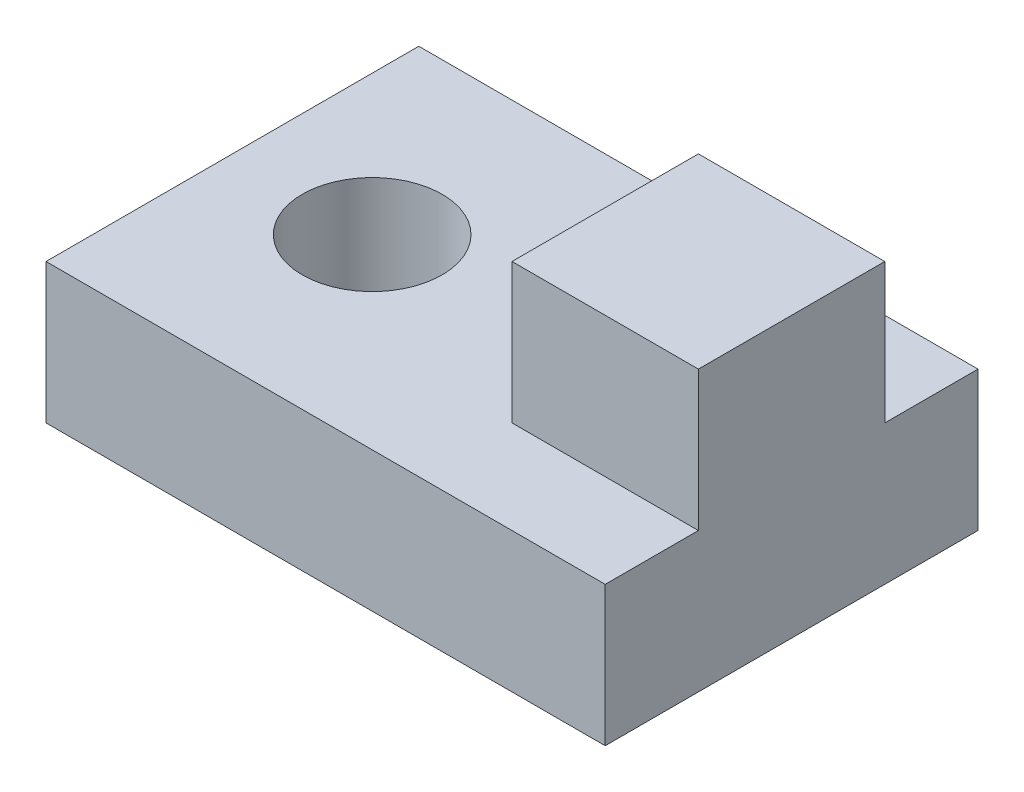
ISO-10303-21;
HEADER;
FILE_DESCRIPTION(('STEP AP214'),'2;1');
FILE_NAME('part.step','',(''),(''),'','','');
FILE_SCHEMA(('AUTOMOTIVE_DESIGN { 1 0 10303 214 1 1 1 1 }'));
ENDSEC;
DATA;
#1=APPLICATION_CONTEXT('core data for automotive mechanical design processes');
#2=APPLICATION_PROTOCOL_DEFINITION('international standard','automotive_design',2000,#1);
#3=PRODUCT_CONTEXT('',#1,'mechanical');
#4=PRODUCT('Part','Part','',(#3));
#5=PRODUCT_RELATED_PRODUCT_CATEGORY('part','',(#4));
#6=PRODUCT_DEFINITION_FORMATION('','',#4);
#7=PRODUCT_DEFINITION_CONTEXT('part definition',#1,'design');
#8=PRODUCT_DEFINITION('design','',#6,#7);
#9=PRODUCT_DEFINITION_SHAPE('','',#8);
#10=(LENGTH_UNIT() NAMED_UNIT(*) SI_UNIT(.MILLI.,.METRE.));
#11=(NAMED_UNIT(*) PLANE_ANGLE_UNIT() SI_UNIT($,.RADIAN.));
#12=(NAMED_UNIT(*) SI_UNIT($,.STERADIAN.) SOLID_ANGLE_UNIT());
#13=UNCERTAINTY_MEASURE_WITH_UNIT(LENGTH_MEASURE(1.E-05),#10,'distance_accuracy_value','');
#14=(GEOMETRIC_REPRESENTATION_CONTEXT(3) GLOBAL_UNCERTAINTY_ASSIGNED_CONTEXT((#13)) GLOBAL_UNIT_ASSIGNED_CONTEXT((#10,
#11,#12)) REPRESENTATION_CONTEXT('',''));
#15=CARTESIAN_POINT('',(0.,0.,0.));
#16=DIRECTION('',(0.,0.,1.));
#17=DIRECTION('',(1.,0.,0.));
#18=AXIS2_PLACEMENT_3D('',#15,#16,#17);
#19=CARTESIAN_POINT('',(-30.,15.,-20.));
#20=DIRECTION('',(1.,0.,0.));
#21=DIRECTION('',(0.,0.,-1.));
#22=AXIS2_PLACEMENT_3D('',#19,#20,#21);
#23=PLANE('',#22);
#24=DIRECTION('',(0.,0.,1.));
#25=VECTOR('',#24,1.);
#26=CARTESIAN_POINT('',(-30.,0.,-20.));
#27=LINE('',#26,#25);
#28=CARTESIAN_POINT('',(-30.,0.,-20.));
#29=VERTEX_POINT('',#28);
#30=CARTESIAN_POINT('',(-30.,0.,20.));
#31=VERTEX_POINT('',#30);
#32=EDGE_CURVE('E145',#29,#31,#27,.T.);
#33=ORIENTED_EDGE('',*,*,#32,.T.);
#34=DIRECTION('',(0.,-1.,0.));
#35=VECTOR('',#34,1.);
#36=CARTESIAN_POINT('',(-30.,15.,20.));
#37=LINE('',#36,#35);
#38=CARTESIAN_POINT('',(-30.,15.,20.));
#39=VERTEX_POINT('',#38);
#40=EDGE_CURVE('E11',#39,#31,#37,.T.);
#41=ORIENTED_EDGE('',*,*,#40,.F.);
#42=DIRECTION('',(0.,0.,1.));
#43=VECTOR('',#42,1.);
#44=CARTESIAN_POINT('',(-30.,15.,-20.));
#45=LINE('',#44,#43);
#46=CARTESIAN_POINT('',(-30.,15.,-20.));
#47=VERTEX_POINT('',#46);
#48=EDGE_CURVE('E146',#47,#39,#45,.T.);
#49=ORIENTED_EDGE('',*,*,#48,.F.);
#50=DIRECTION('',(0.,-1.,0.));
#51=VECTOR('',#50,1.);
#52=CARTESIAN_POINT('',(-30.,15.,-20.));
#53=LINE('',#52,#51);
#54=EDGE_CURVE('E160',#47,#29,#53,.T.);
#55=ORIENTED_EDGE('',*,*,#54,.T.);
#56=EDGE_LOOP('',(#33,#41,#49,#55));
#57=FACE_BOUND('',#56,.T.);
#58=ADVANCED_FACE('F40',(#57),#23,.F.);
#59=CARTESIAN_POINT('',(-30.,15.,20.));
#60=DIRECTION('',(0.,0.,-1.));
#61=DIRECTION('',(-1.,0.,0.));
#62=AXIS2_PLACEMENT_3D('',#59,#60,#61);
#63=PLANE('',#62);
#64=DIRECTION('',(1.,0.,0.));
#65=VECTOR('',#64,1.);
#66=CARTESIAN_POINT('',(-30.,0.,20.));
#67=LINE('',#66,#65);
#68=CARTESIAN_POINT('',(30.,0.,20.));
#69=VERTEX_POINT('',#68);
#70=EDGE_CURVE('E164',#31,#69,#67,.T.);
#71=ORIENTED_EDGE('',*,*,#70,.T.);
#72=DIRECTION('',(0.,-1.,0.));
#73=VECTOR('',#72,1.);
#74=CARTESIAN_POINT('',(30.,15.,20.));
#75=LINE('',#74,#73);
#76=CARTESIAN_POINT('',(30.,15.,20.));
#77=VERTEX_POINT('',#76);
#78=EDGE_CURVE('E48',#77,#69,#75,.T.);
#79=ORIENTED_EDGE('',*,*,#78,.F.);
#80=DIRECTION('',(1.,0.,0.));
#81=VECTOR('',#80,1.);
#82=CARTESIAN_POINT('',(-30.,15.,20.));
#83=LINE('',#82,#81);
#84=EDGE_CURVE('E150',#39,#77,#83,.T.);
#85=ORIENTED_EDGE('',*,*,#84,.F.);
#86=ORIENTED_EDGE('',*,*,#40,.T.);
#87=EDGE_LOOP('',(#71,#79,#85,#86));
#88=FACE_BOUND('',#87,.T.);
#89=ADVANCED_FACE('F212',(#88),#63,.F.);
#90=CARTESIAN_POINT('',(30.,15.,-20.));
#91=DIRECTION('',(-1.,0.,0.));
#92=DIRECTION('',(0.,0.,1.));
#93=AXIS2_PLACEMENT_3D('',#90,#91,#92);
#94=PLANE('',#93);
#95=DIRECTION('',(0.,0.,-1.));
#96=VECTOR('',#95,1.);
#97=CARTESIAN_POINT('',(30.,0.,-20.));
#98=LINE('',#97,#96);
#99=CARTESIAN_POINT('',(30.,0.,-20.));
#100=VERTEX_POINT('',#99);
#101=EDGE_CURVE('E167',#69,#100,#98,.T.);
#102=ORIENTED_EDGE('',*,*,#101,.T.);
#103=DIRECTION('',(0.,-1.,0.));
#104=VECTOR('',#103,1.);
#105=CARTESIAN_POINT('',(30.,15.,-20.));
#106=LINE('',#105,#104);
#107=CARTESIAN_POINT('',(30.,15.,-20.));
#108=VERTEX_POINT('',#107);
#109=EDGE_CURVE('E175',#108,#100,#106,.T.);
#110=ORIENTED_EDGE('',*,*,#109,.F.);
#111=DIRECTION('',(0.,0.,-1.));
#112=VECTOR('',#111,1.);
#113=CARTESIAN_POINT('',(30.,15.,-20.));
#114=LINE('',#113,#112);
#115=CARTESIAN_POINT('',(30.,15.,-10.));
#116=VERTEX_POINT('',#115);
#117=EDGE_CURVE('E128',#116,#108,#114,.T.);
#118=ORIENTED_EDGE('',*,*,#117,.F.);
#119=DIRECTION('',(0.,-1.,0.));
#120=VECTOR('',#119,1.);
#121=CARTESIAN_POINT('',(30.,30.,-10.));
#122=LINE('',#121,#120);
#123=CARTESIAN_POINT('',(30.,30.,-10.));
#124=VERTEX_POINT('',#123);
#125=EDGE_CURVE('E108',#124,#116,#122,.T.);
#126=ORIENTED_EDGE('',*,*,#125,.F.);
#127=DIRECTION('',(0.,0.,-1.));
#128=VECTOR('',#127,1.);
#129=CARTESIAN_POINT('',(30.,30.,-10.));
#130=LINE('',#129,#128);
#131=CARTESIAN_POINT('',(30.,30.,10.));
#132=VERTEX_POINT('',#131);
#133=EDGE_CURVE('E115',#132,#124,#130,.T.);
#134=ORIENTED_EDGE('',*,*,#133,.F.);
#135=DIRECTION('',(0.,-1.,0.));
#136=VECTOR('',#135,1.);
#137=CARTESIAN_POINT('',(30.,30.,10.));
#138=LINE('',#137,#136);
#139=CARTESIAN_POINT('',(30.,15.,10.));
#140=VERTEX_POINT('',#139);
#141=EDGE_CURVE('E310',#132,#140,#138,.T.);
#142=ORIENTED_EDGE('',*,*,#141,.T.);
#143=EDGE_CURVE('E154',#77,#140,#114,.T.);
#144=ORIENTED_EDGE('',*,*,#143,.F.);
#145=ORIENTED_EDGE('',*,*,#78,.T.);
#146=EDGE_LOOP('',(#102,#110,#118,#126,#134,#142,#144,#145));
#147=FACE_BOUND('',#146,.T.);
#148=ADVANCED_FACE('F126',(#147),#94,.F.);
#149=CARTESIAN_POINT('',(-30.,15.,-20.));
#150=DIRECTION('',(0.,0.,1.));
#151=DIRECTION('',(1.,0.,0.));
#152=AXIS2_PLACEMENT_3D('',#149,#150,#151);
#153=PLANE('',#152);
#154=DIRECTION('',(-1.,0.,0.));
#155=VECTOR('',#154,1.);
#156=CARTESIAN_POINT('',(-30.,0.,-20.));
#157=LINE('',#156,#155);
#158=EDGE_CURVE('E151',#100,#29,#157,.T.);
#159=ORIENTED_EDGE('',*,*,#158,.T.);
#160=ORIENTED_EDGE('',*,*,#54,.F.);
#161=DIRECTION('',(-1.,0.,0.));
#162=VECTOR('',#161,1.);
#163=CARTESIAN_POINT('',(-30.,15.,-20.));
#164=LINE('',#163,#162);
#165=EDGE_CURVE('E157',#108,#47,#164,.T.);
#166=ORIENTED_EDGE('',*,*,#165,.F.);
#167=ORIENTED_EDGE('',*,*,#109,.T.);
#168=EDGE_LOOP('',(#159,#160,#166,#167));
#169=FACE_BOUND('',#168,.T.);
#170=ADVANCED_FACE('F191',(#169),#153,.F.);
#171=CARTESIAN_POINT('',(0.,15.,0.));
#172=DIRECTION('',(0.,1.,0.));
#173=DIRECTION('',(0.,0.,1.));
#174=AXIS2_PLACEMENT_3D('',#171,#172,#173);
#175=PLANE('',#174);
#176=DIRECTION('',(1.,0.,0.));
#177=VECTOR('',#176,1.);
#178=CARTESIAN_POINT('',(30.,15.,10.));
#179=LINE('',#178,#177);
#180=CARTESIAN_POINT('',(10.,15.,10.));
#181=VERTEX_POINT('',#180);
#182=EDGE_CURVE('E55',#181,#140,#179,.T.);
#183=ORIENTED_EDGE('',*,*,#182,.F.);
#184=DIRECTION('',(0.,0.,1.));
#185=VECTOR('',#184,1.);
#186=CARTESIAN_POINT('',(10.,15.,-10.));
#187=LINE('',#186,#185);
#188=CARTESIAN_POINT('',(10.,15.,-10.));
#189=VERTEX_POINT('',#188);
#190=EDGE_CURVE('E313',#189,#181,#187,.T.);
#191=ORIENTED_EDGE('',*,*,#190,.F.);
#192=DIRECTION('',(-1.,0.,0.));
#193=VECTOR('',#192,1.);
#194=CARTESIAN_POINT('',(30.,15.,-10.));
#195=LINE('',#194,#193);
#196=EDGE_CURVE('E61',#116,#189,#195,.T.);
#197=ORIENTED_EDGE('',*,*,#196,.F.);
#198=ORIENTED_EDGE('',*,*,#117,.T.);
#199=ORIENTED_EDGE('',*,*,#165,.T.);
#200=ORIENTED_EDGE('',*,*,#48,.T.);
#201=ORIENTED_EDGE('',*,*,#84,.T.);
#202=ORIENTED_EDGE('',*,*,#143,.T.);
#203=EDGE_LOOP('',(#183,#191,#197,#198,#199,#200,#201,#202));
#204=FACE_BOUND('',#203,.T.);
#205=CARTESIAN_POINT('',(-15.,15.,0.));
#206=DIRECTION('',(0.,1.,0.));
#207=DIRECTION('',(0.,0.,1.));
#208=AXIS2_PLACEMENT_3D('',#205,#206,#207);
#209=CIRCLE('',#208,7.5);
#210=CARTESIAN_POINT('',(-15.,15.,7.5));
#211=VERTEX_POINT('',#210);
#212=EDGE_CURVE('E130',#211,#211,#209,.T.);
#213=ORIENTED_EDGE('',*,*,#212,.F.);
#214=EDGE_LOOP('',(#213));
#215=FACE_BOUND('',#214,.T.);
#216=ADVANCED_FACE('F196',(#204,#215),#175,.T.);
#217=CARTESIAN_POINT('',(0.,0.,0.));
#218=DIRECTION('',(0.,1.,0.));
#219=DIRECTION('',(0.,0.,1.));
#220=AXIS2_PLACEMENT_3D('',#217,#218,#219);
#221=PLANE('',#220);
#222=CARTESIAN_POINT('',(-15.,0.,0.));
#223=DIRECTION('',(0.,1.,0.));
#224=DIRECTION('',(0.,0.,1.));
#225=AXIS2_PLACEMENT_3D('',#222,#223,#224);
#226=CIRCLE('',#225,7.5);
#227=CARTESIAN_POINT('',(-15.,0.,7.5));
#228=VERTEX_POINT('',#227);
#229=EDGE_CURVE('E136',#228,#228,#226,.F.);
#230=ORIENTED_EDGE('',*,*,#229,.F.);
#231=EDGE_LOOP('',(#230));
#232=FACE_BOUND('',#231,.T.);
#233=ORIENTED_EDGE('',*,*,#32,.F.);
#234=ORIENTED_EDGE('',*,*,#158,.F.);
#235=ORIENTED_EDGE('',*,*,#101,.F.);
#236=ORIENTED_EDGE('',*,*,#70,.F.);
#237=EDGE_LOOP('',(#233,#234,#235,#236));
#238=FACE_BOUND('',#237,.T.);
#239=ADVANCED_FACE('F188',(#232,#238),#221,.F.);
#240=CARTESIAN_POINT('',(-15.,-0.001000000000001,0.));
#241=DIRECTION('',(0.,1.,0.));
#242=DIRECTION('',(0.,0.,1.));
#243=AXIS2_PLACEMENT_3D('',#240,#241,#242);
#244=CYLINDRICAL_SURFACE('',#243,7.5);
#245=ORIENTED_EDGE('',*,*,#212,.T.);
#246=EDGE_LOOP('',(#245));
#247=FACE_BOUND('',#246,.T.);
#248=ORIENTED_EDGE('',*,*,#229,.T.);
#249=EDGE_LOOP('',(#248));
#250=FACE_BOUND('',#249,.T.);
#251=ADVANCED_FACE('F224',(#247,#250),#244,.F.);
#252=CARTESIAN_POINT('',(30.,30.,-10.));
#253=DIRECTION('',(0.,0.,1.));
#254=DIRECTION('',(1.,0.,0.));
#255=AXIS2_PLACEMENT_3D('',#252,#253,#254);
#256=PLANE('',#255);
#257=ORIENTED_EDGE('',*,*,#196,.T.);
#258=DIRECTION('',(0.,-1.,0.));
#259=VECTOR('',#258,1.);
#260=CARTESIAN_POINT('',(10.,30.,-10.));
#261=LINE('',#260,#259);
#262=CARTESIAN_POINT('',(10.,30.,-10.));
#263=VERTEX_POINT('',#262);
#264=EDGE_CURVE('E110',#263,#189,#261,.T.);
#265=ORIENTED_EDGE('',*,*,#264,.F.);
#266=DIRECTION('',(-1.,0.,0.));
#267=VECTOR('',#266,1.);
#268=CARTESIAN_POINT('',(30.,30.,-10.));
#269=LINE('',#268,#267);
#270=EDGE_CURVE('E104',#124,#263,#269,.T.);
#271=ORIENTED_EDGE('',*,*,#270,.F.);
#272=ORIENTED_EDGE('',*,*,#125,.T.);
#273=EDGE_LOOP('',(#257,#265,#271,#272));
#274=FACE_BOUND('',#273,.T.);
#275=ADVANCED_FACE('F106',(#274),#256,.F.);
#276=CARTESIAN_POINT('',(10.,30.,-10.));
#277=DIRECTION('',(1.,0.,0.));
#278=DIRECTION('',(0.,0.,-1.));
#279=AXIS2_PLACEMENT_3D('',#276,#277,#278);
#280=PLANE('',#279);
#281=ORIENTED_EDGE('',*,*,#190,.T.);
#282=DIRECTION('',(0.,-1.,0.));
#283=VECTOR('',#282,1.);
#284=CARTESIAN_POINT('',(10.,30.,10.));
#285=LINE('',#284,#283);
#286=CARTESIAN_POINT('',(10.,30.,10.));
#287=VERTEX_POINT('',#286);
#288=EDGE_CURVE('E138',#287,#181,#285,.T.);
#289=ORIENTED_EDGE('',*,*,#288,.F.);
#290=DIRECTION('',(0.,0.,1.));
#291=VECTOR('',#290,1.);
#292=CARTESIAN_POINT('',(10.,30.,-10.));
#293=LINE('',#292,#291);
#294=EDGE_CURVE('E114',#263,#287,#293,.T.);
#295=ORIENTED_EDGE('',*,*,#294,.F.);
#296=ORIENTED_EDGE('',*,*,#264,.T.);
#297=EDGE_LOOP('',(#281,#289,#295,#296));
#298=FACE_BOUND('',#297,.T.);
#299=ADVANCED_FACE('F233',(#298),#280,.F.);
#300=CARTESIAN_POINT('',(30.,30.,10.));
#301=DIRECTION('',(0.,0.,-1.));
#302=DIRECTION('',(-1.,0.,0.));
#303=AXIS2_PLACEMENT_3D('',#300,#301,#302);
#304=PLANE('',#303);
#305=ORIENTED_EDGE('',*,*,#182,.T.);
#306=ORIENTED_EDGE('',*,*,#141,.F.);
#307=DIRECTION('',(1.,0.,0.));
#308=VECTOR('',#307,1.);
#309=CARTESIAN_POINT('',(30.,30.,10.));
#310=LINE('',#309,#308);
#311=EDGE_CURVE('E120',#287,#132,#310,.T.);
#312=ORIENTED_EDGE('',*,*,#311,.F.);
#313=ORIENTED_EDGE('',*,*,#288,.T.);
#314=EDGE_LOOP('',(#305,#306,#312,#313));
#315=FACE_BOUND('',#314,.T.);
#316=ADVANCED_FACE('F236',(#315),#304,.F.);
#317=CARTESIAN_POINT('',(0.,30.,0.));
#318=DIRECTION('',(0.,-1.,0.));
#319=DIRECTION('',(0.,0.,-1.));
#320=AXIS2_PLACEMENT_3D('',#317,#318,#319);
#321=PLANE('',#320);
#322=ORIENTED_EDGE('',*,*,#133,.T.);
#323=ORIENTED_EDGE('',*,*,#270,.T.);
#324=ORIENTED_EDGE('',*,*,#294,.T.);
#325=ORIENTED_EDGE('',*,*,#311,.T.);
#326=EDGE_LOOP('',(#322,#323,#324,#325));
#327=FACE_BOUND('',#326,.T.);
#328=ADVANCED_FACE('F118',(#327),#321,.F.);
#329=CLOSED_SHELL('',(#58,#89,#148,#170,#216,#239,#251,#275,#299,#316,#328));
#330=MANIFOLD_SOLID_BREP('B2',#329);
#331=ADVANCED_BREP_SHAPE_REPRESENTATION('',(#18,#330),#14);
#332=SHAPE_DEFINITION_REPRESENTATION(#9,#331);
ENDSEC;
END-ISO-10303-21;
